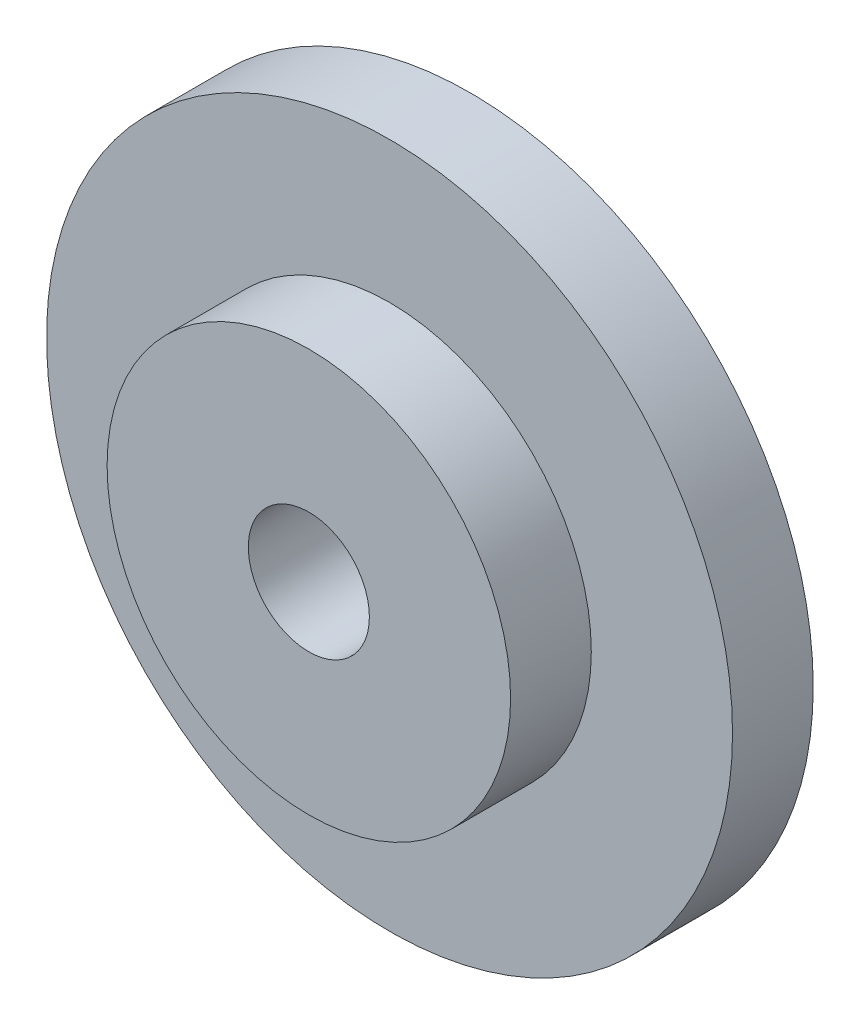
ISO-10303-21;
HEADER;
FILE_DESCRIPTION(('STEP AP214'),'2;1');
FILE_NAME('part.step','',(''),(''),'','','');
FILE_SCHEMA(('AUTOMOTIVE_DESIGN { 1 0 10303 214 1 1 1 1 }'));
ENDSEC;
DATA;
#1=APPLICATION_CONTEXT('core data for automotive mechanical design processes');
#2=APPLICATION_PROTOCOL_DEFINITION('international standard','automotive_design',2000,#1);
#3=PRODUCT_CONTEXT('',#1,'mechanical');
#4=PRODUCT('Part','Part','',(#3));
#5=PRODUCT_RELATED_PRODUCT_CATEGORY('part','',(#4));
#6=PRODUCT_DEFINITION_FORMATION('','',#4);
#7=PRODUCT_DEFINITION_CONTEXT('part definition',#1,'design');
#8=PRODUCT_DEFINITION('design','',#6,#7);
#9=PRODUCT_DEFINITION_SHAPE('','',#8);
#10=(LENGTH_UNIT() NAMED_UNIT(*) SI_UNIT(.MILLI.,.METRE.));
#11=(NAMED_UNIT(*) PLANE_ANGLE_UNIT() SI_UNIT($,.RADIAN.));
#12=(NAMED_UNIT(*) SI_UNIT($,.STERADIAN.) SOLID_ANGLE_UNIT());
#13=UNCERTAINTY_MEASURE_WITH_UNIT(LENGTH_MEASURE(1.E-05),#10,'distance_accuracy_value','');
#14=(GEOMETRIC_REPRESENTATION_CONTEXT(3) GLOBAL_UNCERTAINTY_ASSIGNED_CONTEXT((#13)) GLOBAL_UNIT_ASSIGNED_CONTEXT((#10,
#11,#12)) REPRESENTATION_CONTEXT('',''));
#15=CARTESIAN_POINT('',(0.,0.,0.));
#16=DIRECTION('',(0.,0.,1.));
#17=DIRECTION('',(1.,0.,0.));
#18=AXIS2_PLACEMENT_3D('',#15,#16,#17);
#19=CARTESIAN_POINT('',(0.,0.,2.));
#20=DIRECTION('',(0.,0.,-1.));
#21=DIRECTION('',(-1.,0.,0.));
#22=AXIS2_PLACEMENT_3D('',#19,#20,#21);
#23=CYLINDRICAL_SURFACE('',#22,8.5);
#24=CARTESIAN_POINT('',(0.,0.,2.));
#25=DIRECTION('',(0.,0.,1.));
#26=DIRECTION('',(1.,0.,0.));
#27=AXIS2_PLACEMENT_3D('',#24,#25,#26);
#28=CIRCLE('',#27,8.5);
#29=CARTESIAN_POINT('',(8.5,0.,2.));
#30=VERTEX_POINT('',#29);
#31=EDGE_CURVE('E42',#30,#30,#28,.T.);
#32=ORIENTED_EDGE('',*,*,#31,.F.);
#33=EDGE_LOOP('',(#32));
#34=FACE_BOUND('',#33,.T.);
#35=CARTESIAN_POINT('',(0.,0.,0.));
#36=DIRECTION('',(0.,0.,1.));
#37=DIRECTION('',(1.,0.,0.));
#38=AXIS2_PLACEMENT_3D('',#35,#36,#37);
#39=CIRCLE('',#38,8.5);
#40=CARTESIAN_POINT('',(8.5,0.,0.));
#41=VERTEX_POINT('',#40);
#42=EDGE_CURVE('E38',#41,#41,#39,.T.);
#43=ORIENTED_EDGE('',*,*,#42,.T.);
#44=EDGE_LOOP('',(#43));
#45=FACE_BOUND('',#44,.T.);
#46=ADVANCED_FACE('F35',(#34,#45),#23,.T.);
#47=CARTESIAN_POINT('',(0.,0.,2.));
#48=DIRECTION('',(0.,0.,1.));
#49=DIRECTION('',(1.,0.,0.));
#50=AXIS2_PLACEMENT_3D('',#47,#48,#49);
#51=PLANE('',#50);
#52=CARTESIAN_POINT('',(0.,0.,2.));
#53=DIRECTION('',(0.,0.,1.));
#54=DIRECTION('',(1.,0.,0.));
#55=AXIS2_PLACEMENT_3D('',#52,#53,#54);
#56=CIRCLE('',#55,5.);
#57=CARTESIAN_POINT('',(5.,0.,2.));
#58=VERTEX_POINT('',#57);
#59=EDGE_CURVE('E10',#58,#58,#56,.T.);
#60=ORIENTED_EDGE('',*,*,#59,.F.);
#61=EDGE_LOOP('',(#60));
#62=FACE_BOUND('',#61,.T.);
#63=ORIENTED_EDGE('',*,*,#31,.T.);
#64=EDGE_LOOP('',(#63));
#65=FACE_BOUND('',#64,.T.);
#66=ADVANCED_FACE('F79',(#62,#65),#51,.T.);
#67=CARTESIAN_POINT('',(0.,0.,0.));
#68=DIRECTION('',(0.,0.,1.));
#69=DIRECTION('',(1.,0.,0.));
#70=AXIS2_PLACEMENT_3D('',#67,#68,#69);
#71=PLANE('',#70);
#72=CARTESIAN_POINT('',(0.,0.,0.));
#73=DIRECTION('',(0.,0.,1.));
#74=DIRECTION('',(1.,0.,0.));
#75=AXIS2_PLACEMENT_3D('',#72,#73,#74);
#76=CIRCLE('',#75,1.5);
#77=CARTESIAN_POINT('',(1.5,0.,0.));
#78=VERTEX_POINT('',#77);
#79=EDGE_CURVE('E51',#78,#78,#76,.T.);
#80=ORIENTED_EDGE('',*,*,#79,.T.);
#81=EDGE_LOOP('',(#80));
#82=FACE_BOUND('',#81,.T.);
#83=ORIENTED_EDGE('',*,*,#42,.F.);
#84=EDGE_LOOP('',(#83));
#85=FACE_BOUND('',#84,.T.);
#86=ADVANCED_FACE('F58',(#82,#85),#71,.F.);
#87=CARTESIAN_POINT('',(0.,0.,4.));
#88=DIRECTION('',(0.,0.,-1.));
#89=DIRECTION('',(-1.,0.,0.));
#90=AXIS2_PLACEMENT_3D('',#87,#88,#89);
#91=CYLINDRICAL_SURFACE('',#90,5.);
#92=CARTESIAN_POINT('',(0.,0.,4.));
#93=DIRECTION('',(0.,0.,1.));
#94=DIRECTION('',(1.,0.,0.));
#95=AXIS2_PLACEMENT_3D('',#92,#93,#94);
#96=CIRCLE('',#95,5.);
#97=CARTESIAN_POINT('',(5.,0.,4.));
#98=VERTEX_POINT('',#97);
#99=EDGE_CURVE('E48',#98,#98,#96,.T.);
#100=ORIENTED_EDGE('',*,*,#99,.F.);
#101=EDGE_LOOP('',(#100));
#102=FACE_BOUND('',#101,.T.);
#103=ORIENTED_EDGE('',*,*,#59,.T.);
#104=EDGE_LOOP('',(#103));
#105=FACE_BOUND('',#104,.T.);
#106=ADVANCED_FACE('F70',(#102,#105),#91,.T.);
#107=CARTESIAN_POINT('',(0.,0.,4.));
#108=DIRECTION('',(0.,0.,1.));
#109=DIRECTION('',(1.,0.,0.));
#110=AXIS2_PLACEMENT_3D('',#107,#108,#109);
#111=PLANE('',#110);
#112=CARTESIAN_POINT('',(0.,0.,4.));
#113=DIRECTION('',(0.,0.,1.));
#114=DIRECTION('',(1.,0.,0.));
#115=AXIS2_PLACEMENT_3D('',#112,#113,#114);
#116=CIRCLE('',#115,1.5);
#117=CARTESIAN_POINT('',(1.5,0.,4.));
#118=VERTEX_POINT('',#117);
#119=EDGE_CURVE('E52',#118,#118,#116,.T.);
#120=ORIENTED_EDGE('',*,*,#119,.F.);
#121=EDGE_LOOP('',(#120));
#122=FACE_BOUND('',#121,.T.);
#123=ORIENTED_EDGE('',*,*,#99,.T.);
#124=EDGE_LOOP('',(#123));
#125=FACE_BOUND('',#124,.T.);
#126=ADVANCED_FACE('F64',(#122,#125),#111,.T.);
#127=CARTESIAN_POINT('',(0.,0.,0.));
#128=DIRECTION('',(0.,0.,1.));
#129=DIRECTION('',(1.,0.,0.));
#130=AXIS2_PLACEMENT_3D('',#127,#128,#129);
#131=CYLINDRICAL_SURFACE('',#130,1.5);
#132=ORIENTED_EDGE('',*,*,#79,.F.);
#133=EDGE_LOOP('',(#132));
#134=FACE_BOUND('',#133,.T.);
#135=ORIENTED_EDGE('',*,*,#119,.T.);
#136=EDGE_LOOP('',(#135));
#137=FACE_BOUND('',#136,.T.);
#138=ADVANCED_FACE('F61',(#134,#137),#131,.F.);
#139=CLOSED_SHELL('',(#46,#66,#86,#106,#126,#138));
#140=MANIFOLD_SOLID_BREP('B2',#139);
#141=ADVANCED_BREP_SHAPE_REPRESENTATION('',(#18,#140),#14);
#142=SHAPE_DEFINITION_REPRESENTATION(#9,#141);
ENDSEC;
END-ISO-10303-21;
